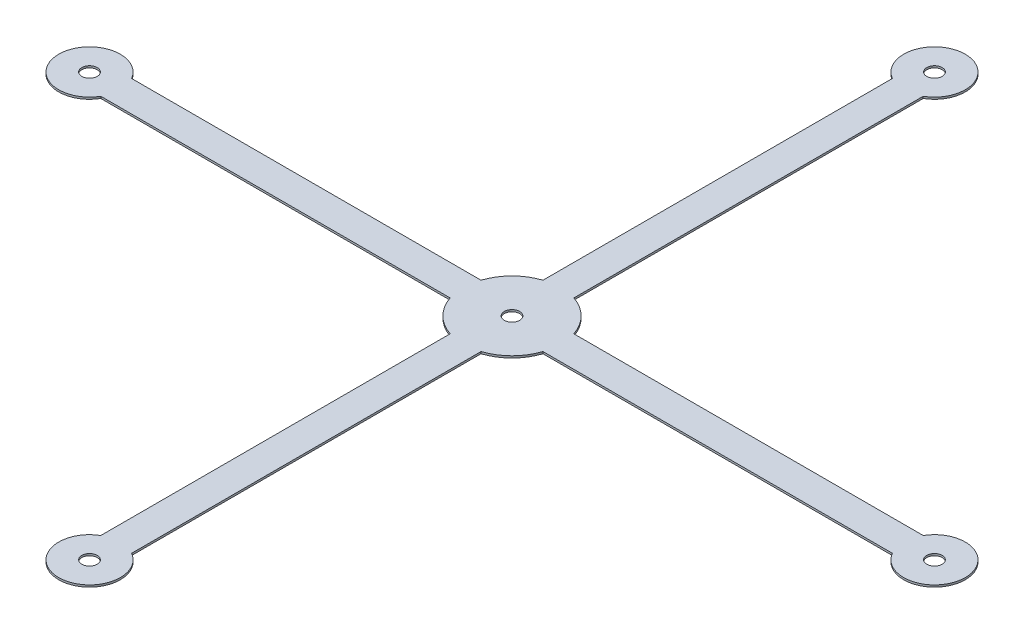
ISO-10303-21;
HEADER;
FILE_DESCRIPTION(('STEP AP214'),'2;1');
FILE_NAME('part.step','',(''),(''),'','','');
FILE_SCHEMA(('AUTOMOTIVE_DESIGN { 1 0 10303 214 1 1 1 1 }'));
ENDSEC;
DATA;
#1=APPLICATION_CONTEXT('core data for automotive mechanical design processes');
#2=APPLICATION_PROTOCOL_DEFINITION('international standard','automotive_design',2000,#1);
#3=PRODUCT_CONTEXT('',#1,'mechanical');
#4=PRODUCT('Part','Part','',(#3));
#5=PRODUCT_RELATED_PRODUCT_CATEGORY('part','',(#4));
#6=PRODUCT_DEFINITION_FORMATION('','',#4);
#7=PRODUCT_DEFINITION_CONTEXT('part definition',#1,'design');
#8=PRODUCT_DEFINITION('design','',#6,#7);
#9=PRODUCT_DEFINITION_SHAPE('','',#8);
#10=(LENGTH_UNIT() NAMED_UNIT(*) SI_UNIT(.MILLI.,.METRE.));
#11=(NAMED_UNIT(*) PLANE_ANGLE_UNIT() SI_UNIT($,.RADIAN.));
#12=(NAMED_UNIT(*) SI_UNIT($,.STERADIAN.) SOLID_ANGLE_UNIT());
#13=UNCERTAINTY_MEASURE_WITH_UNIT(LENGTH_MEASURE(1.E-05),#10,'distance_accuracy_value','');
#14=(GEOMETRIC_REPRESENTATION_CONTEXT(3) GLOBAL_UNCERTAINTY_ASSIGNED_CONTEXT((#13)) GLOBAL_UNIT_ASSIGNED_CONTEXT((#10,
#11,#12)) REPRESENTATION_CONTEXT('',''));
#15=CARTESIAN_POINT('',(0.,0.,0.));
#16=DIRECTION('',(0.,0.,1.));
#17=DIRECTION('',(1.,0.,0.));
#18=AXIS2_PLACEMENT_3D('',#15,#16,#17);
#19=CARTESIAN_POINT('',(-54.864,0.254,0.));
#20=DIRECTION('',(0.,1.,0.));
#21=DIRECTION('',(0.,0.,1.));
#22=AXIS2_PLACEMENT_3D('',#19,#20,#21);
#23=PLANE('',#22);
#24=CARTESIAN_POINT('',(54.864,0.254,0.));
#25=DIRECTION('',(0.,1.,0.));
#26=DIRECTION('',(0.,0.,1.));
#27=AXIS2_PLACEMENT_3D('',#24,#25,#26);
#28=CIRCLE('',#27,4.00000000000001);
#29=CARTESIAN_POINT('',(51.3998983848623,0.254,1.99999999999999));
#30=VERTEX_POINT('',#29);
#31=CARTESIAN_POINT('',(51.3998983848623,0.254,-2.00000000000001));
#32=VERTEX_POINT('',#31);
#33=EDGE_CURVE('E158',#30,#32,#28,.T.);
#34=ORIENTED_EDGE('',*,*,#33,.T.);
#35=DIRECTION('',(1.,0.,0.));
#36=VECTOR('',#35,1.);
#37=CARTESIAN_POINT('',(51.3998983848623,0.254,-2.00000000000001));
#38=LINE('',#37,#36);
#39=CARTESIAN_POINT('',(6.02681507929356,0.254,-1.99999999999994));
#40=VERTEX_POINT('',#39);
#41=EDGE_CURVE('E165',#40,#32,#38,.T.);
#42=ORIENTED_EDGE('',*,*,#41,.F.);
#43=CARTESIAN_POINT('',(0.,0.254,0.));
#44=DIRECTION('',(0.,1.,0.));
#45=DIRECTION('',(0.,0.,1.));
#46=AXIS2_PLACEMENT_3D('',#43,#44,#45);
#47=CIRCLE('',#46,6.35);
#48=CARTESIAN_POINT('',(2.00000000000004,0.254,-6.02681507929353));
#49=VERTEX_POINT('',#48);
#50=EDGE_CURVE('E147',#40,#49,#47,.T.);
#51=ORIENTED_EDGE('',*,*,#50,.T.);
#52=DIRECTION('',(0.,0.,1.));
#53=VECTOR('',#52,1.);
#54=CARTESIAN_POINT('',(1.99999999999999,0.254,-51.3998983848623));
#55=LINE('',#54,#53);
#56=CARTESIAN_POINT('',(1.99999999999999,0.254,-51.3998983848623));
#57=VERTEX_POINT('',#56);
#58=EDGE_CURVE('E190',#57,#49,#55,.T.);
#59=ORIENTED_EDGE('',*,*,#58,.F.);
#60=CARTESIAN_POINT('',(0.,0.254,-54.864));
#61=DIRECTION('',(0.,1.,0.));
#62=DIRECTION('',(0.,0.,1.));
#63=AXIS2_PLACEMENT_3D('',#60,#61,#62);
#64=CIRCLE('',#63,4.00000000000001);
#65=CARTESIAN_POINT('',(-2.00000000000001,0.254,-51.3998983848623));
#66=VERTEX_POINT('',#65);
#67=EDGE_CURVE('E157',#57,#66,#64,.T.);
#68=ORIENTED_EDGE('',*,*,#67,.T.);
#69=DIRECTION('',(0.,0.,-1.));
#70=VECTOR('',#69,1.);
#71=CARTESIAN_POINT('',(-2.00000000000001,0.254,-51.3998983848623));
#72=LINE('',#71,#70);
#73=CARTESIAN_POINT('',(-1.99999999999996,0.254,-6.02681507929355));
#74=VERTEX_POINT('',#73);
#75=EDGE_CURVE('E181',#74,#66,#72,.T.);
#76=ORIENTED_EDGE('',*,*,#75,.F.);
#77=CARTESIAN_POINT('',(0.,0.254,0.));
#78=DIRECTION('',(0.,1.,0.));
#79=DIRECTION('',(0.,0.,1.));
#80=AXIS2_PLACEMENT_3D('',#77,#78,#79);
#81=CIRCLE('',#80,6.35);
#82=CARTESIAN_POINT('',(-6.02681507929353,0.254,-2.00000000000002));
#83=VERTEX_POINT('',#82);
#84=EDGE_CURVE('E273',#74,#83,#81,.T.);
#85=ORIENTED_EDGE('',*,*,#84,.T.);
#86=DIRECTION('',(1.,0.,0.));
#87=VECTOR('',#86,1.);
#88=CARTESIAN_POINT('',(-51.3998983848623,0.254,-2.));
#89=LINE('',#88,#87);
#90=CARTESIAN_POINT('',(-51.3998983848623,0.254,-2.));
#91=VERTEX_POINT('',#90);
#92=EDGE_CURVE('E205',#91,#83,#89,.T.);
#93=ORIENTED_EDGE('',*,*,#92,.F.);
#94=CARTESIAN_POINT('',(-54.864,0.254,0.));
#95=DIRECTION('',(0.,1.,0.));
#96=DIRECTION('',(0.,0.,1.));
#97=AXIS2_PLACEMENT_3D('',#94,#95,#96);
#98=CIRCLE('',#97,4.00000000000001);
#99=CARTESIAN_POINT('',(-51.3998983848623,0.254,2.));
#100=VERTEX_POINT('',#99);
#101=EDGE_CURVE('E262',#91,#100,#98,.T.);
#102=ORIENTED_EDGE('',*,*,#101,.T.);
#103=DIRECTION('',(-1.,0.,0.));
#104=VECTOR('',#103,1.);
#105=CARTESIAN_POINT('',(-51.3998983848623,0.254,2.));
#106=LINE('',#105,#104);
#107=CARTESIAN_POINT('',(-6.02681507929355,0.254,1.99999999999998));
#108=VERTEX_POINT('',#107);
#109=EDGE_CURVE('E196',#108,#100,#106,.T.);
#110=ORIENTED_EDGE('',*,*,#109,.F.);
#111=CARTESIAN_POINT('',(0.,0.254,0.));
#112=DIRECTION('',(0.,1.,0.));
#113=DIRECTION('',(0.,0.,1.));
#114=AXIS2_PLACEMENT_3D('',#111,#112,#113);
#115=CIRCLE('',#114,6.35);
#116=CARTESIAN_POINT('',(-2.,0.254,6.02681507929354));
#117=VERTEX_POINT('',#116);
#118=EDGE_CURVE('E264',#108,#117,#115,.T.);
#119=ORIENTED_EDGE('',*,*,#118,.T.);
#120=DIRECTION('',(0.,0.,-1.));
#121=VECTOR('',#120,1.);
#122=CARTESIAN_POINT('',(-2.,0.254,51.3998983848623));
#123=LINE('',#122,#121);
#124=CARTESIAN_POINT('',(-2.,0.254,51.3998983848623));
#125=VERTEX_POINT('',#124);
#126=EDGE_CURVE('E223',#125,#117,#123,.T.);
#127=ORIENTED_EDGE('',*,*,#126,.F.);
#128=CARTESIAN_POINT('',(0.,0.254,54.864));
#129=DIRECTION('',(0.,1.,0.));
#130=DIRECTION('',(0.,0.,1.));
#131=AXIS2_PLACEMENT_3D('',#128,#129,#130);
#132=CIRCLE('',#131,4.00000000000001);
#133=CARTESIAN_POINT('',(2.,0.254,51.3998983848623));
#134=VERTEX_POINT('',#133);
#135=EDGE_CURVE('E267',#125,#134,#132,.T.);
#136=ORIENTED_EDGE('',*,*,#135,.T.);
#137=DIRECTION('',(0.,0.,1.));
#138=VECTOR('',#137,1.);
#139=CARTESIAN_POINT('',(2.,0.254,51.3998983848623));
#140=LINE('',#139,#138);
#141=CARTESIAN_POINT('',(2.,0.254,6.02681507929354));
#142=VERTEX_POINT('',#141);
#143=EDGE_CURVE('E214',#142,#134,#140,.T.);
#144=ORIENTED_EDGE('',*,*,#143,.F.);
#145=CARTESIAN_POINT('',(0.,0.254,0.));
#146=DIRECTION('',(0.,1.,0.));
#147=DIRECTION('',(0.,0.,1.));
#148=AXIS2_PLACEMENT_3D('',#145,#146,#147);
#149=CIRCLE('',#148,6.35);
#150=CARTESIAN_POINT('',(6.02681507929352,0.254,2.00000000000006));
#151=VERTEX_POINT('',#150);
#152=EDGE_CURVE('E269',#142,#151,#149,.T.);
#153=ORIENTED_EDGE('',*,*,#152,.T.);
#154=DIRECTION('',(-1.,0.,0.));
#155=VECTOR('',#154,1.);
#156=CARTESIAN_POINT('',(51.3998983848623,0.254,1.99999999999999));
#157=LINE('',#156,#155);
#158=EDGE_CURVE('E173',#30,#151,#157,.T.);
#159=ORIENTED_EDGE('',*,*,#158,.F.);
#160=EDGE_LOOP('',(#34,#42,#51,#59,#68,#76,#85,#93,#102,#110,#119,#127,#136,#144,#153,#159));
#161=FACE_BOUND('',#160,.T.);
#162=CARTESIAN_POINT('',(0.,0.254,0.));
#163=DIRECTION('',(0.,1.,0.));
#164=DIRECTION('',(0.,0.,1.));
#165=AXIS2_PLACEMENT_3D('',#162,#163,#164);
#166=CIRCLE('',#165,0.999999999999998);
#167=CARTESIAN_POINT('',(0.,0.254,0.999999999999998));
#168=VERTEX_POINT('',#167);
#169=EDGE_CURVE('E231',#168,#168,#166,.T.);
#170=ORIENTED_EDGE('',*,*,#169,.F.);
#171=EDGE_LOOP('',(#170));
#172=FACE_BOUND('',#171,.T.);
#173=CARTESIAN_POINT('',(54.864,0.254,0.));
#174=DIRECTION('',(0.,1.,0.));
#175=DIRECTION('',(0.,0.,1.));
#176=AXIS2_PLACEMENT_3D('',#173,#174,#175);
#177=CIRCLE('',#176,0.999999999999998);
#178=CARTESIAN_POINT('',(54.864,0.254,0.999999999999984));
#179=VERTEX_POINT('',#178);
#180=EDGE_CURVE('E244',#179,#179,#177,.T.);
#181=ORIENTED_EDGE('',*,*,#180,.F.);
#182=EDGE_LOOP('',(#181));
#183=FACE_BOUND('',#182,.T.);
#184=CARTESIAN_POINT('',(-54.864,0.254,0.));
#185=DIRECTION('',(0.,1.,0.));
#186=DIRECTION('',(0.,0.,1.));
#187=AXIS2_PLACEMENT_3D('',#184,#185,#186);
#188=CIRCLE('',#187,0.999999999999998);
#189=CARTESIAN_POINT('',(-54.864,0.254,1.00000000000001));
#190=VERTEX_POINT('',#189);
#191=EDGE_CURVE('E256',#190,#190,#188,.T.);
#192=ORIENTED_EDGE('',*,*,#191,.F.);
#193=EDGE_LOOP('',(#192));
#194=FACE_BOUND('',#193,.T.);
#195=CARTESIAN_POINT('',(0.,0.254,-54.864));
#196=DIRECTION('',(0.,1.,0.));
#197=DIRECTION('',(0.,0.,1.));
#198=AXIS2_PLACEMENT_3D('',#195,#196,#197);
#199=CIRCLE('',#198,0.999999999999999);
#200=CARTESIAN_POINT('',(0.,0.254,-53.864));
#201=VERTEX_POINT('',#200);
#202=EDGE_CURVE('E250',#201,#201,#199,.T.);
#203=ORIENTED_EDGE('',*,*,#202,.F.);
#204=EDGE_LOOP('',(#203));
#205=FACE_BOUND('',#204,.T.);
#206=CARTESIAN_POINT('',(0.,0.254,54.864));
#207=DIRECTION('',(0.,1.,0.));
#208=DIRECTION('',(0.,0.,1.));
#209=AXIS2_PLACEMENT_3D('',#206,#207,#208);
#210=CIRCLE('',#209,0.999999999999998);
#211=CARTESIAN_POINT('',(0.,0.254,55.864));
#212=VERTEX_POINT('',#211);
#213=EDGE_CURVE('E237',#212,#212,#210,.T.);
#214=ORIENTED_EDGE('',*,*,#213,.F.);
#215=EDGE_LOOP('',(#214));
#216=FACE_BOUND('',#215,.T.);
#217=ADVANCED_FACE('F32',(#161,#172,#183,#194,#205,#216),#23,.T.);
#218=CARTESIAN_POINT('',(-54.864,0.,0.));
#219=DIRECTION('',(0.,1.,0.));
#220=DIRECTION('',(0.,0.,1.));
#221=AXIS2_PLACEMENT_3D('',#218,#219,#220);
#222=PLANE('',#221);
#223=DIRECTION('',(1.,0.,0.));
#224=VECTOR('',#223,1.);
#225=CARTESIAN_POINT('',(-54.864,0.,-1.99999999999984));
#226=LINE('',#225,#224);
#227=CARTESIAN_POINT('',(6.02681507929356,0.,-1.99999999999994));
#228=VERTEX_POINT('',#227);
#229=CARTESIAN_POINT('',(51.3998983848623,0.,-2.00000000000001));
#230=VERTEX_POINT('',#229);
#231=EDGE_CURVE('E11',#228,#230,#226,.T.);
#232=ORIENTED_EDGE('',*,*,#231,.T.);
#233=CARTESIAN_POINT('',(54.864,0.,0.));
#234=DIRECTION('',(0.,1.,0.));
#235=DIRECTION('',(0.,0.,1.));
#236=AXIS2_PLACEMENT_3D('',#233,#234,#235);
#237=CIRCLE('',#236,4.00000000000001);
#238=CARTESIAN_POINT('',(51.3998983848623,0.,1.99999999999999));
#239=VERTEX_POINT('',#238);
#240=EDGE_CURVE('E281',#239,#230,#237,.T.);
#241=ORIENTED_EDGE('',*,*,#240,.F.);
#242=DIRECTION('',(-1.,0.,0.));
#243=VECTOR('',#242,1.);
#244=CARTESIAN_POINT('',(-54.864,0.,2.00000000000016));
#245=LINE('',#244,#243);
#246=CARTESIAN_POINT('',(6.02681507929352,0.,2.00000000000006));
#247=VERTEX_POINT('',#246);
#248=EDGE_CURVE('E40',#239,#247,#245,.T.);
#249=ORIENTED_EDGE('',*,*,#248,.T.);
#250=CARTESIAN_POINT('',(0.,0.,0.));
#251=DIRECTION('',(0.,1.,0.));
#252=DIRECTION('',(0.,0.,1.));
#253=AXIS2_PLACEMENT_3D('',#250,#251,#252);
#254=CIRCLE('',#253,6.35);
#255=CARTESIAN_POINT('',(2.,0.,6.02681507929354));
#256=VERTEX_POINT('',#255);
#257=EDGE_CURVE('E279',#256,#247,#254,.T.);
#258=ORIENTED_EDGE('',*,*,#257,.F.);
#259=DIRECTION('',(0.,0.,1.));
#260=VECTOR('',#259,1.);
#261=CARTESIAN_POINT('',(2.,0.,0.));
#262=LINE('',#261,#260);
#263=CARTESIAN_POINT('',(2.,0.,51.3998983848623));
#264=VERTEX_POINT('',#263);
#265=EDGE_CURVE('E291',#256,#264,#262,.T.);
#266=ORIENTED_EDGE('',*,*,#265,.T.);
#267=CARTESIAN_POINT('',(0.,0.,54.864));
#268=DIRECTION('',(0.,1.,0.));
#269=DIRECTION('',(0.,0.,1.));
#270=AXIS2_PLACEMENT_3D('',#267,#268,#269);
#271=CIRCLE('',#270,4.00000000000001);
#272=CARTESIAN_POINT('',(-2.,0.,51.3998983848623));
#273=VERTEX_POINT('',#272);
#274=EDGE_CURVE('E47',#273,#264,#271,.T.);
#275=ORIENTED_EDGE('',*,*,#274,.F.);
#276=DIRECTION('',(0.,0.,-1.));
#277=VECTOR('',#276,1.);
#278=CARTESIAN_POINT('',(-2.,0.,0.));
#279=LINE('',#278,#277);
#280=CARTESIAN_POINT('',(-2.,0.,6.02681507929354));
#281=VERTEX_POINT('',#280);
#282=EDGE_CURVE('E275',#273,#281,#279,.T.);
#283=ORIENTED_EDGE('',*,*,#282,.T.);
#284=CARTESIAN_POINT('',(0.,0.,0.));
#285=DIRECTION('',(0.,1.,0.));
#286=DIRECTION('',(0.,0.,1.));
#287=AXIS2_PLACEMENT_3D('',#284,#285,#286);
#288=CIRCLE('',#287,6.35);
#289=CARTESIAN_POINT('',(-6.02681507929355,0.,1.99999999999998));
#290=VERTEX_POINT('',#289);
#291=EDGE_CURVE('E55',#290,#281,#288,.T.);
#292=ORIENTED_EDGE('',*,*,#291,.F.);
#293=DIRECTION('',(-1.,0.,0.));
#294=VECTOR('',#293,1.);
#295=CARTESIAN_POINT('',(-54.864,0.,2.00000000000001));
#296=LINE('',#295,#294);
#297=CARTESIAN_POINT('',(-51.3998983848623,0.,2.));
#298=VERTEX_POINT('',#297);
#299=EDGE_CURVE('E296',#290,#298,#296,.T.);
#300=ORIENTED_EDGE('',*,*,#299,.T.);
#301=CARTESIAN_POINT('',(-54.864,0.,0.));
#302=DIRECTION('',(0.,1.,0.));
#303=DIRECTION('',(0.,0.,1.));
#304=AXIS2_PLACEMENT_3D('',#301,#302,#303);
#305=CIRCLE('',#304,4.00000000000001);
#306=CARTESIAN_POINT('',(-51.3998983848623,0.,-2.));
#307=VERTEX_POINT('',#306);
#308=EDGE_CURVE('E259',#307,#298,#305,.T.);
#309=ORIENTED_EDGE('',*,*,#308,.F.);
#310=DIRECTION('',(1.,0.,0.));
#311=VECTOR('',#310,1.);
#312=CARTESIAN_POINT('',(-54.864,0.,-2.));
#313=LINE('',#312,#311);
#314=CARTESIAN_POINT('',(-6.02681507929353,0.,-2.00000000000002));
#315=VERTEX_POINT('',#314);
#316=EDGE_CURVE('E293',#307,#315,#313,.T.);
#317=ORIENTED_EDGE('',*,*,#316,.T.);
#318=CARTESIAN_POINT('',(0.,0.,0.));
#319=DIRECTION('',(0.,1.,0.));
#320=DIRECTION('',(0.,0.,1.));
#321=AXIS2_PLACEMENT_3D('',#318,#319,#320);
#322=CIRCLE('',#321,6.35);
#323=CARTESIAN_POINT('',(-1.99999999999996,0.,-6.02681507929355));
#324=VERTEX_POINT('',#323);
#325=EDGE_CURVE('E265',#324,#315,#322,.T.);
#326=ORIENTED_EDGE('',*,*,#325,.F.);
#327=DIRECTION('',(0.,0.,-1.));
#328=VECTOR('',#327,1.);
#329=CARTESIAN_POINT('',(-1.99999999999995,0.,0.));
#330=LINE('',#329,#328);
#331=CARTESIAN_POINT('',(-2.00000000000001,0.,-51.3998983848623));
#332=VERTEX_POINT('',#331);
#333=EDGE_CURVE('E302',#324,#332,#330,.T.);
#334=ORIENTED_EDGE('',*,*,#333,.T.);
#335=CARTESIAN_POINT('',(0.,0.,-54.864));
#336=DIRECTION('',(0.,1.,0.));
#337=DIRECTION('',(0.,0.,1.));
#338=AXIS2_PLACEMENT_3D('',#335,#336,#337);
#339=CIRCLE('',#338,4.00000000000001);
#340=CARTESIAN_POINT('',(1.99999999999999,0.,-51.3998983848623));
#341=VERTEX_POINT('',#340);
#342=EDGE_CURVE('E285',#341,#332,#339,.T.);
#343=ORIENTED_EDGE('',*,*,#342,.F.);
#344=DIRECTION('',(0.,0.,1.));
#345=VECTOR('',#344,1.);
#346=CARTESIAN_POINT('',(2.00000000000005,0.,0.));
#347=LINE('',#346,#345);
#348=CARTESIAN_POINT('',(2.00000000000004,0.,-6.02681507929353));
#349=VERTEX_POINT('',#348);
#350=EDGE_CURVE('E299',#341,#349,#347,.T.);
#351=ORIENTED_EDGE('',*,*,#350,.T.);
#352=CARTESIAN_POINT('',(0.,0.,0.));
#353=DIRECTION('',(0.,1.,0.));
#354=DIRECTION('',(0.,0.,1.));
#355=AXIS2_PLACEMENT_3D('',#352,#353,#354);
#356=CIRCLE('',#355,6.35);
#357=EDGE_CURVE('E283',#228,#349,#356,.T.);
#358=ORIENTED_EDGE('',*,*,#357,.F.);
#359=EDGE_LOOP('',(#232,#241,#249,#258,#266,#275,#283,#292,#300,#309,#317,#326,#334,#343,#351,#358));
#360=FACE_BOUND('',#359,.T.);
#361=CARTESIAN_POINT('',(0.,0.,0.));
#362=DIRECTION('',(0.,1.,0.));
#363=DIRECTION('',(0.,0.,1.));
#364=AXIS2_PLACEMENT_3D('',#361,#362,#363);
#365=CIRCLE('',#364,0.999999999999998);
#366=CARTESIAN_POINT('',(0.,0.,0.999999999999998));
#367=VERTEX_POINT('',#366);
#368=EDGE_CURVE('E236',#367,#367,#365,.T.);
#369=ORIENTED_EDGE('',*,*,#368,.T.);
#370=EDGE_LOOP('',(#369));
#371=FACE_BOUND('',#370,.T.);
#372=CARTESIAN_POINT('',(-54.864,0.,0.));
#373=DIRECTION('',(0.,1.,0.));
#374=DIRECTION('',(0.,0.,1.));
#375=AXIS2_PLACEMENT_3D('',#372,#373,#374);
#376=CIRCLE('',#375,0.999999999999998);
#377=CARTESIAN_POINT('',(-54.864,0.,1.00000000000001));
#378=VERTEX_POINT('',#377);
#379=EDGE_CURVE('E253',#378,#378,#376,.T.);
#380=ORIENTED_EDGE('',*,*,#379,.T.);
#381=EDGE_LOOP('',(#380));
#382=FACE_BOUND('',#381,.T.);
#383=CARTESIAN_POINT('',(0.,0.,-54.864));
#384=DIRECTION('',(0.,1.,0.));
#385=DIRECTION('',(0.,0.,1.));
#386=AXIS2_PLACEMENT_3D('',#383,#384,#385);
#387=CIRCLE('',#386,0.999999999999999);
#388=CARTESIAN_POINT('',(0.,0.,-53.864));
#389=VERTEX_POINT('',#388);
#390=EDGE_CURVE('E247',#389,#389,#387,.T.);
#391=ORIENTED_EDGE('',*,*,#390,.T.);
#392=EDGE_LOOP('',(#391));
#393=FACE_BOUND('',#392,.T.);
#394=CARTESIAN_POINT('',(54.864,0.,0.));
#395=DIRECTION('',(0.,1.,0.));
#396=DIRECTION('',(0.,0.,1.));
#397=AXIS2_PLACEMENT_3D('',#394,#395,#396);
#398=CIRCLE('',#397,0.999999999999998);
#399=CARTESIAN_POINT('',(54.864,0.,0.999999999999984));
#400=VERTEX_POINT('',#399);
#401=EDGE_CURVE('E240',#400,#400,#398,.T.);
#402=ORIENTED_EDGE('',*,*,#401,.T.);
#403=EDGE_LOOP('',(#402));
#404=FACE_BOUND('',#403,.T.);
#405=CARTESIAN_POINT('',(0.,0.,54.864));
#406=DIRECTION('',(0.,1.,0.));
#407=DIRECTION('',(0.,0.,1.));
#408=AXIS2_PLACEMENT_3D('',#405,#406,#407);
#409=CIRCLE('',#408,0.999999999999998);
#410=CARTESIAN_POINT('',(0.,0.,55.864));
#411=VERTEX_POINT('',#410);
#412=EDGE_CURVE('E241',#411,#411,#409,.T.);
#413=ORIENTED_EDGE('',*,*,#412,.T.);
#414=EDGE_LOOP('',(#413));
#415=FACE_BOUND('',#414,.T.);
#416=ADVANCED_FACE('F306',(#360,#371,#382,#393,#404,#415),#222,.F.);
#417=CARTESIAN_POINT('',(-54.864,0.254,0.));
#418=DIRECTION('',(0.,-1.,0.));
#419=DIRECTION('',(0.,0.,-1.));
#420=AXIS2_PLACEMENT_3D('',#417,#418,#419);
#421=CYLINDRICAL_SURFACE('',#420,4.00000000000001);
#422=ORIENTED_EDGE('',*,*,#308,.T.);
#423=DIRECTION('',(0.,1.,0.));
#424=VECTOR('',#423,1.);
#425=CARTESIAN_POINT('',(-51.3998983848623,-9.746,2.));
#426=LINE('',#425,#424);
#427=EDGE_CURVE('E202',#298,#100,#426,.T.);
#428=ORIENTED_EDGE('',*,*,#427,.T.);
#429=ORIENTED_EDGE('',*,*,#101,.F.);
#430=DIRECTION('',(0.,1.,0.));
#431=VECTOR('',#430,1.);
#432=CARTESIAN_POINT('',(-51.3998983848623,-9.746,-2.));
#433=LINE('',#432,#431);
#434=EDGE_CURVE('E210',#307,#91,#433,.T.);
#435=ORIENTED_EDGE('',*,*,#434,.F.);
#436=EDGE_LOOP('',(#422,#428,#429,#435));
#437=FACE_BOUND('',#436,.T.);
#438=ADVANCED_FACE('F34',(#437),#421,.T.);
#439=CARTESIAN_POINT('',(0.,0.254,0.));
#440=DIRECTION('',(0.,-1.,0.));
#441=DIRECTION('',(0.,0.,-1.));
#442=AXIS2_PLACEMENT_3D('',#439,#440,#441);
#443=CYLINDRICAL_SURFACE('',#442,6.35);
#444=ORIENTED_EDGE('',*,*,#291,.T.);
#445=DIRECTION('',(0.,1.,0.));
#446=VECTOR('',#445,1.);
#447=CARTESIAN_POINT('',(-2.,-9.746,6.02681507929354));
#448=LINE('',#447,#446);
#449=EDGE_CURVE('E229',#281,#117,#448,.T.);
#450=ORIENTED_EDGE('',*,*,#449,.T.);
#451=ORIENTED_EDGE('',*,*,#118,.F.);
#452=DIRECTION('',(0.,1.,0.));
#453=VECTOR('',#452,1.);
#454=CARTESIAN_POINT('',(-6.02681507929355,-9.746,1.99999999999998));
#455=LINE('',#454,#453);
#456=EDGE_CURVE('E201',#290,#108,#455,.T.);
#457=ORIENTED_EDGE('',*,*,#456,.F.);
#458=EDGE_LOOP('',(#444,#450,#451,#457));
#459=FACE_BOUND('',#458,.T.);
#460=ADVANCED_FACE('F342',(#459),#443,.T.);
#461=CARTESIAN_POINT('',(0.,0.254,54.864));
#462=DIRECTION('',(0.,-1.,0.));
#463=DIRECTION('',(0.,0.,-1.));
#464=AXIS2_PLACEMENT_3D('',#461,#462,#463);
#465=CYLINDRICAL_SURFACE('',#464,4.00000000000001);
#466=ORIENTED_EDGE('',*,*,#274,.T.);
#467=DIRECTION('',(0.,1.,0.));
#468=VECTOR('',#467,1.);
#469=CARTESIAN_POINT('',(2.,-9.746,51.3998983848623));
#470=LINE('',#469,#468);
#471=EDGE_CURVE('E220',#264,#134,#470,.T.);
#472=ORIENTED_EDGE('',*,*,#471,.T.);
#473=ORIENTED_EDGE('',*,*,#135,.F.);
#474=DIRECTION('',(0.,1.,0.));
#475=VECTOR('',#474,1.);
#476=CARTESIAN_POINT('',(-2.,-9.746,51.3998983848623));
#477=LINE('',#476,#475);
#478=EDGE_CURVE('E228',#273,#125,#477,.T.);
#479=ORIENTED_EDGE('',*,*,#478,.F.);
#480=EDGE_LOOP('',(#466,#472,#473,#479));
#481=FACE_BOUND('',#480,.T.);
#482=ADVANCED_FACE('F347',(#481),#465,.T.);
#483=CARTESIAN_POINT('',(0.,0.254,0.));
#484=DIRECTION('',(0.,-1.,0.));
#485=DIRECTION('',(0.,0.,-1.));
#486=AXIS2_PLACEMENT_3D('',#483,#484,#485);
#487=CYLINDRICAL_SURFACE('',#486,6.35);
#488=ORIENTED_EDGE('',*,*,#257,.T.);
#489=DIRECTION('',(0.,1.,0.));
#490=VECTOR('',#489,1.);
#491=CARTESIAN_POINT('',(6.02681507929352,-9.746,2.00000000000006));
#492=LINE('',#491,#490);
#493=EDGE_CURVE('E178',#247,#151,#492,.T.);
#494=ORIENTED_EDGE('',*,*,#493,.T.);
#495=ORIENTED_EDGE('',*,*,#152,.F.);
#496=DIRECTION('',(0.,1.,0.));
#497=VECTOR('',#496,1.);
#498=CARTESIAN_POINT('',(2.,-9.746,6.02681507929354));
#499=LINE('',#498,#497);
#500=EDGE_CURVE('E219',#256,#142,#499,.T.);
#501=ORIENTED_EDGE('',*,*,#500,.F.);
#502=EDGE_LOOP('',(#488,#494,#495,#501));
#503=FACE_BOUND('',#502,.T.);
#504=ADVANCED_FACE('F354',(#503),#487,.T.);
#505=CARTESIAN_POINT('',(54.864,0.254,0.));
#506=DIRECTION('',(0.,-1.,0.));
#507=DIRECTION('',(0.,0.,-1.));
#508=AXIS2_PLACEMENT_3D('',#505,#506,#507);
#509=CYLINDRICAL_SURFACE('',#508,4.00000000000001);
#510=ORIENTED_EDGE('',*,*,#240,.T.);
#511=DIRECTION('',(0.,1.,0.));
#512=VECTOR('',#511,1.);
#513=CARTESIAN_POINT('',(51.3998983848623,-9.746,-2.00000000000001));
#514=LINE('',#513,#512);
#515=EDGE_CURVE('E166',#230,#32,#514,.T.);
#516=ORIENTED_EDGE('',*,*,#515,.T.);
#517=ORIENTED_EDGE('',*,*,#33,.F.);
#518=DIRECTION('',(0.,1.,0.));
#519=VECTOR('',#518,1.);
#520=CARTESIAN_POINT('',(51.3998983848623,-9.746,1.99999999999999));
#521=LINE('',#520,#519);
#522=EDGE_CURVE('E177',#239,#30,#521,.T.);
#523=ORIENTED_EDGE('',*,*,#522,.F.);
#524=EDGE_LOOP('',(#510,#516,#517,#523));
#525=FACE_BOUND('',#524,.T.);
#526=ADVANCED_FACE('F314',(#525),#509,.T.);
#527=CARTESIAN_POINT('',(0.,0.254,0.));
#528=DIRECTION('',(0.,-1.,0.));
#529=DIRECTION('',(0.,0.,-1.));
#530=AXIS2_PLACEMENT_3D('',#527,#528,#529);
#531=CYLINDRICAL_SURFACE('',#530,6.35);
#532=ORIENTED_EDGE('',*,*,#357,.T.);
#533=DIRECTION('',(0.,1.,0.));
#534=VECTOR('',#533,1.);
#535=CARTESIAN_POINT('',(2.00000000000004,-9.746,-6.02681507929353));
#536=LINE('',#535,#534);
#537=EDGE_CURVE('E152',#349,#49,#536,.T.);
#538=ORIENTED_EDGE('',*,*,#537,.T.);
#539=ORIENTED_EDGE('',*,*,#50,.F.);
#540=DIRECTION('',(0.,1.,0.));
#541=VECTOR('',#540,1.);
#542=CARTESIAN_POINT('',(6.02681507929356,-9.746,-1.99999999999994));
#543=LINE('',#542,#541);
#544=EDGE_CURVE('E150',#228,#40,#543,.T.);
#545=ORIENTED_EDGE('',*,*,#544,.F.);
#546=EDGE_LOOP('',(#532,#538,#539,#545));
#547=FACE_BOUND('',#546,.T.);
#548=ADVANCED_FACE('F149',(#547),#531,.T.);
#549=CARTESIAN_POINT('',(0.,0.254,-54.864));
#550=DIRECTION('',(0.,-1.,0.));
#551=DIRECTION('',(0.,0.,-1.));
#552=AXIS2_PLACEMENT_3D('',#549,#550,#551);
#553=CYLINDRICAL_SURFACE('',#552,4.00000000000001);
#554=ORIENTED_EDGE('',*,*,#342,.T.);
#555=DIRECTION('',(0.,1.,0.));
#556=VECTOR('',#555,1.);
#557=CARTESIAN_POINT('',(-2.00000000000001,-9.746,-51.3998983848623));
#558=LINE('',#557,#556);
#559=EDGE_CURVE('E187',#332,#66,#558,.T.);
#560=ORIENTED_EDGE('',*,*,#559,.T.);
#561=ORIENTED_EDGE('',*,*,#67,.F.);
#562=DIRECTION('',(0.,1.,0.));
#563=VECTOR('',#562,1.);
#564=CARTESIAN_POINT('',(1.99999999999999,-9.746,-51.3998983848623));
#565=LINE('',#564,#563);
#566=EDGE_CURVE('E194',#341,#57,#565,.T.);
#567=ORIENTED_EDGE('',*,*,#566,.F.);
#568=EDGE_LOOP('',(#554,#560,#561,#567));
#569=FACE_BOUND('',#568,.T.);
#570=ADVANCED_FACE('F322',(#569),#553,.T.);
#571=CARTESIAN_POINT('',(0.,0.254,0.));
#572=DIRECTION('',(0.,-1.,0.));
#573=DIRECTION('',(0.,0.,-1.));
#574=AXIS2_PLACEMENT_3D('',#571,#572,#573);
#575=CYLINDRICAL_SURFACE('',#574,6.35);
#576=ORIENTED_EDGE('',*,*,#325,.T.);
#577=DIRECTION('',(0.,1.,0.));
#578=VECTOR('',#577,1.);
#579=CARTESIAN_POINT('',(-6.02681507929353,-9.746,-2.00000000000002));
#580=LINE('',#579,#578);
#581=EDGE_CURVE('E211',#315,#83,#580,.T.);
#582=ORIENTED_EDGE('',*,*,#581,.T.);
#583=ORIENTED_EDGE('',*,*,#84,.F.);
#584=DIRECTION('',(0.,1.,0.));
#585=VECTOR('',#584,1.);
#586=CARTESIAN_POINT('',(-1.99999999999996,-9.746,-6.02681507929355));
#587=LINE('',#586,#585);
#588=EDGE_CURVE('E186',#324,#74,#587,.T.);
#589=ORIENTED_EDGE('',*,*,#588,.F.);
#590=EDGE_LOOP('',(#576,#582,#583,#589));
#591=FACE_BOUND('',#590,.T.);
#592=ADVANCED_FACE('F328',(#591),#575,.T.);
#593=CARTESIAN_POINT('',(-54.864,0.254,0.));
#594=DIRECTION('',(0.,-1.,0.));
#595=DIRECTION('',(0.,0.,-1.));
#596=AXIS2_PLACEMENT_3D('',#593,#594,#595);
#597=CYLINDRICAL_SURFACE('',#596,0.999999999999998);
#598=ORIENTED_EDGE('',*,*,#191,.T.);
#599=EDGE_LOOP('',(#598));
#600=FACE_BOUND('',#599,.T.);
#601=ORIENTED_EDGE('',*,*,#379,.F.);
#602=EDGE_LOOP('',(#601));
#603=FACE_BOUND('',#602,.T.);
#604=ADVANCED_FACE('F370',(#600,#603),#597,.F.);
#605=CARTESIAN_POINT('',(0.,0.254,-54.864));
#606=DIRECTION('',(0.,-1.,0.));
#607=DIRECTION('',(0.,0.,-1.));
#608=AXIS2_PLACEMENT_3D('',#605,#606,#607);
#609=CYLINDRICAL_SURFACE('',#608,0.999999999999999);
#610=ORIENTED_EDGE('',*,*,#202,.T.);
#611=EDGE_LOOP('',(#610));
#612=FACE_BOUND('',#611,.T.);
#613=ORIENTED_EDGE('',*,*,#390,.F.);
#614=EDGE_LOOP('',(#613));
#615=FACE_BOUND('',#614,.T.);
#616=ADVANCED_FACE('F397',(#612,#615),#609,.F.);
#617=CARTESIAN_POINT('',(54.864,0.254,0.));
#618=DIRECTION('',(0.,-1.,0.));
#619=DIRECTION('',(0.,0.,-1.));
#620=AXIS2_PLACEMENT_3D('',#617,#618,#619);
#621=CYLINDRICAL_SURFACE('',#620,0.999999999999998);
#622=ORIENTED_EDGE('',*,*,#180,.T.);
#623=EDGE_LOOP('',(#622));
#624=FACE_BOUND('',#623,.T.);
#625=ORIENTED_EDGE('',*,*,#401,.F.);
#626=EDGE_LOOP('',(#625));
#627=FACE_BOUND('',#626,.T.);
#628=ADVANCED_FACE('F404',(#624,#627),#621,.F.);
#629=CARTESIAN_POINT('',(0.,0.254,54.864));
#630=DIRECTION('',(0.,-1.,0.));
#631=DIRECTION('',(0.,0.,-1.));
#632=AXIS2_PLACEMENT_3D('',#629,#630,#631);
#633=CYLINDRICAL_SURFACE('',#632,0.999999999999998);
#634=ORIENTED_EDGE('',*,*,#213,.T.);
#635=EDGE_LOOP('',(#634));
#636=FACE_BOUND('',#635,.T.);
#637=ORIENTED_EDGE('',*,*,#412,.F.);
#638=EDGE_LOOP('',(#637));
#639=FACE_BOUND('',#638,.T.);
#640=ADVANCED_FACE('F411',(#636,#639),#633,.F.);
#641=CARTESIAN_POINT('',(0.,-9.746,0.));
#642=DIRECTION('',(0.,1.,0.));
#643=DIRECTION('',(0.,0.,1.));
#644=AXIS2_PLACEMENT_3D('',#641,#642,#643);
#645=CYLINDRICAL_SURFACE('',#644,0.999999999999998);
#646=ORIENTED_EDGE('',*,*,#169,.T.);
#647=EDGE_LOOP('',(#646));
#648=FACE_BOUND('',#647,.T.);
#649=ORIENTED_EDGE('',*,*,#368,.F.);
#650=EDGE_LOOP('',(#649));
#651=FACE_BOUND('',#650,.T.);
#652=ADVANCED_FACE('F419',(#648,#651),#645,.F.);
#653=CARTESIAN_POINT('',(-2.,-9.746,51.3998983848623));
#654=DIRECTION('',(1.,0.,0.));
#655=DIRECTION('',(0.,0.,-1.));
#656=AXIS2_PLACEMENT_3D('',#653,#654,#655);
#657=PLANE('',#656);
#658=ORIENTED_EDGE('',*,*,#478,.T.);
#659=ORIENTED_EDGE('',*,*,#126,.T.);
#660=ORIENTED_EDGE('',*,*,#449,.F.);
#661=ORIENTED_EDGE('',*,*,#282,.F.);
#662=EDGE_LOOP('',(#658,#659,#660,#661));
#663=FACE_BOUND('',#662,.T.);
#664=ADVANCED_FACE('F344',(#663),#657,.F.);
#665=CARTESIAN_POINT('',(2.,-9.746,51.3998983848623));
#666=DIRECTION('',(-1.,0.,0.));
#667=DIRECTION('',(0.,0.,1.));
#668=AXIS2_PLACEMENT_3D('',#665,#666,#667);
#669=PLANE('',#668);
#670=ORIENTED_EDGE('',*,*,#500,.T.);
#671=ORIENTED_EDGE('',*,*,#143,.T.);
#672=ORIENTED_EDGE('',*,*,#471,.F.);
#673=ORIENTED_EDGE('',*,*,#265,.F.);
#674=EDGE_LOOP('',(#670,#671,#672,#673));
#675=FACE_BOUND('',#674,.T.);
#676=ADVANCED_FACE('F351',(#675),#669,.F.);
#677=CARTESIAN_POINT('',(-51.3998983848623,-9.746,-2.));
#678=DIRECTION('',(0.,0.,1.));
#679=DIRECTION('',(1.,0.,0.));
#680=AXIS2_PLACEMENT_3D('',#677,#678,#679);
#681=PLANE('',#680);
#682=ORIENTED_EDGE('',*,*,#434,.T.);
#683=ORIENTED_EDGE('',*,*,#92,.T.);
#684=ORIENTED_EDGE('',*,*,#581,.F.);
#685=ORIENTED_EDGE('',*,*,#316,.F.);
#686=EDGE_LOOP('',(#682,#683,#684,#685));
#687=FACE_BOUND('',#686,.T.);
#688=ADVANCED_FACE('F333',(#687),#681,.F.);
#689=CARTESIAN_POINT('',(-51.3998983848623,-9.746,2.));
#690=DIRECTION('',(0.,0.,-1.));
#691=DIRECTION('',(-1.,0.,0.));
#692=AXIS2_PLACEMENT_3D('',#689,#690,#691);
#693=PLANE('',#692);
#694=ORIENTED_EDGE('',*,*,#456,.T.);
#695=ORIENTED_EDGE('',*,*,#109,.T.);
#696=ORIENTED_EDGE('',*,*,#427,.F.);
#697=ORIENTED_EDGE('',*,*,#299,.F.);
#698=EDGE_LOOP('',(#694,#695,#696,#697));
#699=FACE_BOUND('',#698,.T.);
#700=ADVANCED_FACE('F340',(#699),#693,.F.);
#701=CARTESIAN_POINT('',(1.99999999999999,-9.746,-51.3998983848623));
#702=DIRECTION('',(-1.,0.,0.));
#703=DIRECTION('',(0.,0.,1.));
#704=AXIS2_PLACEMENT_3D('',#701,#702,#703);
#705=PLANE('',#704);
#706=ORIENTED_EDGE('',*,*,#566,.T.);
#707=ORIENTED_EDGE('',*,*,#58,.T.);
#708=ORIENTED_EDGE('',*,*,#537,.F.);
#709=ORIENTED_EDGE('',*,*,#350,.F.);
#710=EDGE_LOOP('',(#706,#707,#708,#709));
#711=FACE_BOUND('',#710,.T.);
#712=ADVANCED_FACE('F317',(#711),#705,.F.);
#713=CARTESIAN_POINT('',(-2.00000000000001,-9.746,-51.3998983848623));
#714=DIRECTION('',(1.,0.,0.));
#715=DIRECTION('',(0.,0.,-1.));
#716=AXIS2_PLACEMENT_3D('',#713,#714,#715);
#717=PLANE('',#716);
#718=ORIENTED_EDGE('',*,*,#588,.T.);
#719=ORIENTED_EDGE('',*,*,#75,.T.);
#720=ORIENTED_EDGE('',*,*,#559,.F.);
#721=ORIENTED_EDGE('',*,*,#333,.F.);
#722=EDGE_LOOP('',(#718,#719,#720,#721));
#723=FACE_BOUND('',#722,.T.);
#724=ADVANCED_FACE('F325',(#723),#717,.F.);
#725=CARTESIAN_POINT('',(51.3998983848623,-9.746,1.99999999999999));
#726=DIRECTION('',(0.,0.,-1.));
#727=DIRECTION('',(-1.,0.,0.));
#728=AXIS2_PLACEMENT_3D('',#725,#726,#727);
#729=PLANE('',#728);
#730=ORIENTED_EDGE('',*,*,#522,.T.);
#731=ORIENTED_EDGE('',*,*,#158,.T.);
#732=ORIENTED_EDGE('',*,*,#493,.F.);
#733=ORIENTED_EDGE('',*,*,#248,.F.);
#734=EDGE_LOOP('',(#730,#731,#732,#733));
#735=FACE_BOUND('',#734,.T.);
#736=ADVANCED_FACE('F312',(#735),#729,.F.);
#737=CARTESIAN_POINT('',(51.3998983848623,-9.746,-2.00000000000001));
#738=DIRECTION('',(0.,0.,1.));
#739=DIRECTION('',(1.,0.,0.));
#740=AXIS2_PLACEMENT_3D('',#737,#738,#739);
#741=PLANE('',#740);
#742=ORIENTED_EDGE('',*,*,#544,.T.);
#743=ORIENTED_EDGE('',*,*,#41,.T.);
#744=ORIENTED_EDGE('',*,*,#515,.F.);
#745=ORIENTED_EDGE('',*,*,#231,.F.);
#746=EDGE_LOOP('',(#742,#743,#744,#745));
#747=FACE_BOUND('',#746,.T.);
#748=ADVANCED_FACE('F163',(#747),#741,.F.);
#749=CLOSED_SHELL('',(#217,#416,#438,#460,#482,#504,#526,#548,#570,#592,#604,#616,#628,#640,
#652,#664,#676,#688,#700,#712,#724,#736,#748));
#750=MANIFOLD_SOLID_BREP('B2',#749);
#751=ADVANCED_BREP_SHAPE_REPRESENTATION('',(#18,#750),#14);
#752=SHAPE_DEFINITION_REPRESENTATION(#9,#751);
ENDSEC;
END-ISO-10303-21;
